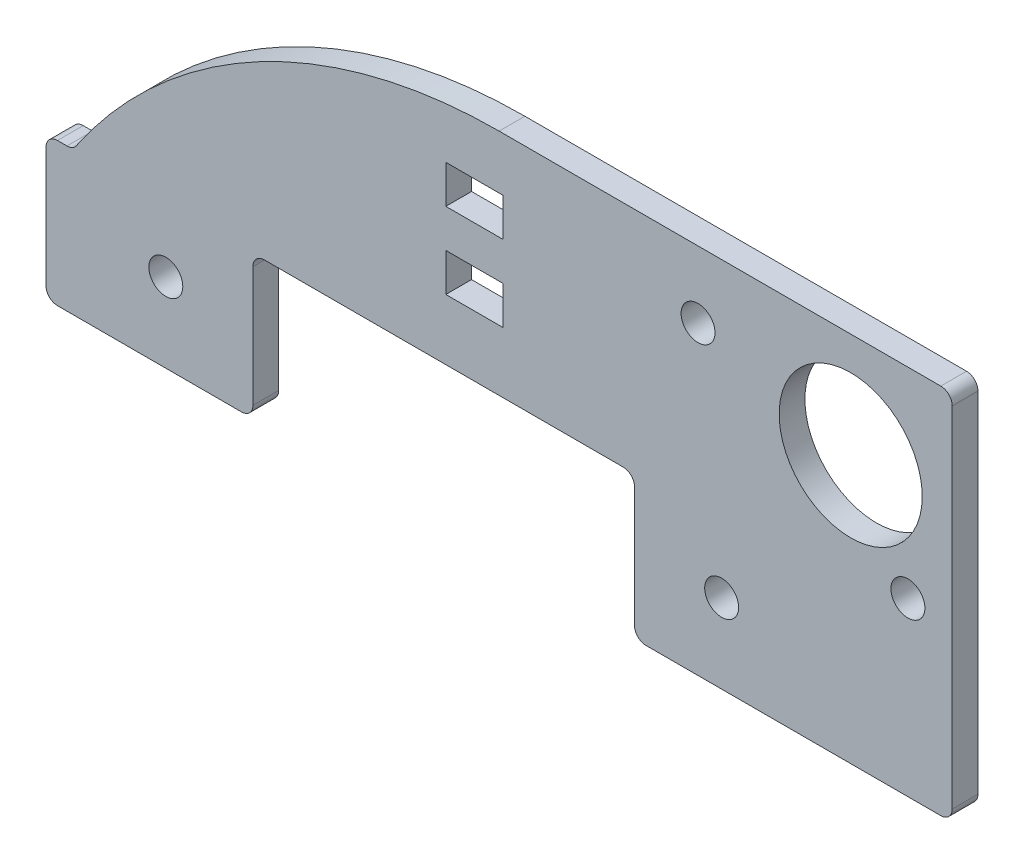
ISO-10303-21;
HEADER;
FILE_DESCRIPTION(('STEP AP214'),'2;1');
FILE_NAME('part.step','',(''),(''),'','','');
FILE_SCHEMA(('AUTOMOTIVE_DESIGN { 1 0 10303 214 1 1 1 1 }'));
ENDSEC;
DATA;
#1=APPLICATION_CONTEXT('core data for automotive mechanical design processes');
#2=APPLICATION_PROTOCOL_DEFINITION('international standard','automotive_design',2000,#1);
#3=PRODUCT_CONTEXT('',#1,'mechanical');
#4=PRODUCT('Part','Part','',(#3));
#5=PRODUCT_RELATED_PRODUCT_CATEGORY('part','',(#4));
#6=PRODUCT_DEFINITION_FORMATION('','',#4);
#7=PRODUCT_DEFINITION_CONTEXT('part definition',#1,'design');
#8=PRODUCT_DEFINITION('design','',#6,#7);
#9=PRODUCT_DEFINITION_SHAPE('','',#8);
#10=(LENGTH_UNIT() NAMED_UNIT(*) SI_UNIT(.MILLI.,.METRE.));
#11=(NAMED_UNIT(*) PLANE_ANGLE_UNIT() SI_UNIT($,.RADIAN.));
#12=(NAMED_UNIT(*) SI_UNIT($,.STERADIAN.) SOLID_ANGLE_UNIT());
#13=UNCERTAINTY_MEASURE_WITH_UNIT(LENGTH_MEASURE(1.E-05),#10,'distance_accuracy_value','');
#14=(GEOMETRIC_REPRESENTATION_CONTEXT(3) GLOBAL_UNCERTAINTY_ASSIGNED_CONTEXT((#13)) GLOBAL_UNIT_ASSIGNED_CONTEXT((#10,
#11,#12)) REPRESENTATION_CONTEXT('',''));
#15=CARTESIAN_POINT('',(0.,0.,0.));
#16=DIRECTION('',(0.,0.,1.));
#17=DIRECTION('',(1.,0.,0.));
#18=AXIS2_PLACEMENT_3D('',#15,#16,#17);
#19=CARTESIAN_POINT('',(-30.1625,9.24499999999995,1.7145));
#20=DIRECTION('',(0.,1.,0.));
#21=DIRECTION('',(-1.,0.,0.));
#22=AXIS2_PLACEMENT_3D('',#19,#20,#21);
#23=PLANE('',#22);
#24=DIRECTION('',(1.,0.,0.));
#25=VECTOR('',#24,1.);
#26=CARTESIAN_POINT('',(-30.1625,9.24499999999995,0.));
#27=LINE('',#26,#25);
#28=CARTESIAN_POINT('',(-29.4005,9.24499999999995,0.));
#29=VERTEX_POINT('',#28);
#30=CARTESIAN_POINT('',(-17.148900043,9.24499999999995,0.));
#31=VERTEX_POINT('',#30);
#32=EDGE_CURVE('E337',#29,#31,#27,.T.);
#33=ORIENTED_EDGE('',*,*,#32,.T.);
#34=DIRECTION('',(0.,0.,1.));
#35=VECTOR('',#34,1.);
#36=CARTESIAN_POINT('',(-17.148900043,9.24499999999995,1.7145));
#37=LINE('',#36,#35);
#38=CARTESIAN_POINT('',(-17.148900043,9.24499999999995,1.7145));
#39=VERTEX_POINT('',#38);
#40=EDGE_CURVE('E385',#31,#39,#37,.T.);
#41=ORIENTED_EDGE('',*,*,#40,.T.);
#42=DIRECTION('',(1.,0.,0.));
#43=VECTOR('',#42,1.);
#44=CARTESIAN_POINT('',(-30.1625,9.24499999999995,1.7145));
#45=LINE('',#44,#43);
#46=CARTESIAN_POINT('',(-29.4005,9.24499999999995,1.7145));
#47=VERTEX_POINT('',#46);
#48=EDGE_CURVE('E319',#47,#39,#45,.T.);
#49=ORIENTED_EDGE('',*,*,#48,.F.);
#50=DIRECTION('',(0.,0.,-1.));
#51=VECTOR('',#50,1.);
#52=CARTESIAN_POINT('',(-29.4005,9.24499999999995,1.7145));
#53=LINE('',#52,#51);
#54=EDGE_CURVE('E382',#47,#29,#53,.T.);
#55=ORIENTED_EDGE('',*,*,#54,.T.);
#56=EDGE_LOOP('',(#33,#41,#49,#55));
#57=FACE_BOUND('',#56,.T.);
#58=ADVANCED_FACE('F33',(#57),#23,.F.);
#59=CARTESIAN_POINT('',(0.,0.,1.7145));
#60=DIRECTION('',(0.,0.,1.));
#61=DIRECTION('',(1.,0.,0.));
#62=AXIS2_PLACEMENT_3D('',#59,#60,#61);
#63=PLANE('',#62);
#64=DIRECTION('',(0.,1.,0.));
#65=VECTOR('',#64,1.);
#66=CARTESIAN_POINT('',(9.01309995700001,18.77,1.7145));
#67=LINE('',#66,#65);
#68=CARTESIAN_POINT('',(9.013099957,10.007,1.7145));
#69=VERTEX_POINT('',#68);
#70=CARTESIAN_POINT('',(9.01309995700001,18.008,1.7145));
#71=VERTEX_POINT('',#70);
#72=EDGE_CURVE('E438',#69,#71,#67,.T.);
#73=ORIENTED_EDGE('',*,*,#72,.F.);
#74=CARTESIAN_POINT('',(9.775099957,10.007,1.7145));
#75=DIRECTION('',(0.,0.,1.));
#76=DIRECTION('',(1.,0.,0.));
#77=AXIS2_PLACEMENT_3D('',#74,#75,#76);
#78=CIRCLE('',#77,0.762);
#79=CARTESIAN_POINT('',(9.77509995699999,9.24499999999995,1.7145));
#80=VERTEX_POINT('',#79);
#81=EDGE_CURVE('E363',#69,#80,#78,.T.);
#82=ORIENTED_EDGE('',*,*,#81,.T.);
#83=CARTESIAN_POINT('',(29.4005,9.24499999999995,1.7145));
#84=VERTEX_POINT('',#83);
#85=EDGE_CURVE('E318',#80,#84,#45,.T.);
#86=ORIENTED_EDGE('',*,*,#85,.T.);
#87=CARTESIAN_POINT('',(29.4005,10.007,1.7145));
#88=DIRECTION('',(0.,0.,1.));
#89=DIRECTION('',(1.,0.,0.));
#90=AXIS2_PLACEMENT_3D('',#87,#88,#89);
#91=CIRCLE('',#90,0.762);
#92=CARTESIAN_POINT('',(30.1625,10.007,1.7145));
#93=VERTEX_POINT('',#92);
#94=EDGE_CURVE('E356',#84,#93,#91,.T.);
#95=ORIENTED_EDGE('',*,*,#94,.T.);
#96=DIRECTION('',(0.,1.,0.));
#97=VECTOR('',#96,1.);
#98=CARTESIAN_POINT('',(30.1625,34.0099999999999,1.7145));
#99=LINE('',#98,#97);
#100=CARTESIAN_POINT('',(30.1625,33.2479999999999,1.7145));
#101=VERTEX_POINT('',#100);
#102=EDGE_CURVE('E322',#93,#101,#99,.T.);
#103=ORIENTED_EDGE('',*,*,#102,.T.);
#104=CARTESIAN_POINT('',(29.4005,33.2479999999999,1.7145));
#105=DIRECTION('',(0.,0.,1.));
#106=DIRECTION('',(1.,0.,0.));
#107=AXIS2_PLACEMENT_3D('',#104,#105,#106);
#108=CIRCLE('',#107,0.762);
#109=CARTESIAN_POINT('',(29.4005,34.0099999999999,1.7145));
#110=VERTEX_POINT('',#109);
#111=EDGE_CURVE('E358',#101,#110,#108,.T.);
#112=ORIENTED_EDGE('',*,*,#111,.T.);
#113=DIRECTION('',(-1.,0.,0.));
#114=VECTOR('',#113,1.);
#115=CARTESIAN_POINT('',(30.1625,34.0099999999999,1.7145));
#116=LINE('',#115,#114);
#117=CARTESIAN_POINT('',(0.,34.0099999999999,1.7145));
#118=VERTEX_POINT('',#117);
#119=EDGE_CURVE('E325',#110,#118,#116,.T.);
#120=ORIENTED_EDGE('',*,*,#119,.T.);
#121=CARTESIAN_POINT('',(0.,0.,1.7145));
#122=DIRECTION('',(0.,0.,1.));
#123=DIRECTION('',(1.,0.,0.));
#124=AXIS2_PLACEMENT_3D('',#121,#122,#123);
#125=CIRCLE('',#124,34.0099999999999);
#126=CARTESIAN_POINT('',(-28.1374900737837,19.1039721615092,1.7145));
#127=VERTEX_POINT('',#126);
#128=EDGE_CURVE('E327',#118,#127,#125,.T.);
#129=ORIENTED_EDGE('',*,*,#128,.T.);
#130=CARTESIAN_POINT('',(-28.7679154614998,19.5319999999999,1.7145));
#131=DIRECTION('',(0.,0.,1.));
#132=DIRECTION('',(1.,0.,0.));
#133=AXIS2_PLACEMENT_3D('',#130,#131,#132);
#134=CIRCLE('',#133,0.762);
#135=CARTESIAN_POINT('',(-28.7679154614998,18.7699999999999,1.7145));
#136=VERTEX_POINT('',#135);
#137=EDGE_CURVE('E412',#127,#136,#134,.F.);
#138=ORIENTED_EDGE('',*,*,#137,.T.);
#139=DIRECTION('',(-1.,0.,0.));
#140=VECTOR('',#139,1.);
#141=CARTESIAN_POINT('',(-30.1625,18.7699999999999,1.7145));
#142=LINE('',#141,#140);
#143=CARTESIAN_POINT('',(-29.4005,18.7699999999999,1.7145));
#144=VERTEX_POINT('',#143);
#145=EDGE_CURVE('E311',#136,#144,#142,.T.);
#146=ORIENTED_EDGE('',*,*,#145,.T.);
#147=CARTESIAN_POINT('',(-29.4005,18.0079999999999,1.7145));
#148=DIRECTION('',(0.,0.,1.));
#149=DIRECTION('',(1.,0.,0.));
#150=AXIS2_PLACEMENT_3D('',#147,#148,#149);
#151=CIRCLE('',#150,0.762);
#152=CARTESIAN_POINT('',(-30.1625,18.0079999999999,1.7145));
#153=VERTEX_POINT('',#152);
#154=EDGE_CURVE('E352',#144,#153,#151,.T.);
#155=ORIENTED_EDGE('',*,*,#154,.T.);
#156=DIRECTION('',(0.,-1.,0.));
#157=VECTOR('',#156,1.);
#158=CARTESIAN_POINT('',(-30.1625,18.7699999999999,1.7145));
#159=LINE('',#158,#157);
#160=CARTESIAN_POINT('',(-30.1625,10.0069999999999,1.7145));
#161=VERTEX_POINT('',#160);
#162=EDGE_CURVE('E314',#153,#161,#159,.T.);
#163=ORIENTED_EDGE('',*,*,#162,.T.);
#164=CARTESIAN_POINT('',(-29.4005,10.0069999999999,1.7145));
#165=DIRECTION('',(0.,0.,1.));
#166=DIRECTION('',(1.,0.,0.));
#167=AXIS2_PLACEMENT_3D('',#164,#165,#166);
#168=CIRCLE('',#167,0.762);
#169=EDGE_CURVE('E354',#161,#47,#168,.T.);
#170=ORIENTED_EDGE('',*,*,#169,.T.);
#171=ORIENTED_EDGE('',*,*,#48,.T.);
#172=CARTESIAN_POINT('',(-17.148900043,10.0069999999999,1.7145));
#173=DIRECTION('',(0.,0.,1.));
#174=DIRECTION('',(1.,0.,0.));
#175=AXIS2_PLACEMENT_3D('',#172,#173,#174);
#176=CIRCLE('',#175,0.762);
#177=CARTESIAN_POINT('',(-16.386900043,10.007,1.7145));
#178=VERTEX_POINT('',#177);
#179=EDGE_CURVE('E360',#39,#178,#176,.T.);
#180=ORIENTED_EDGE('',*,*,#179,.T.);
#181=DIRECTION('',(0.,-1.,0.));
#182=VECTOR('',#181,1.);
#183=CARTESIAN_POINT('',(-16.386900043,18.7699999999999,1.7145));
#184=LINE('',#183,#182);
#185=CARTESIAN_POINT('',(-16.386900043,18.0079999999999,1.7145));
#186=VERTEX_POINT('',#185);
#187=EDGE_CURVE('E432',#186,#178,#184,.T.);
#188=ORIENTED_EDGE('',*,*,#187,.F.);
#189=CARTESIAN_POINT('',(-15.624900043,18.0079999999999,1.7145));
#190=DIRECTION('',(0.,0.,1.));
#191=DIRECTION('',(1.,0.,0.));
#192=AXIS2_PLACEMENT_3D('',#189,#190,#191);
#193=CIRCLE('',#192,0.762);
#194=CARTESIAN_POINT('',(-15.624900043,18.7699999999999,1.7145));
#195=VERTEX_POINT('',#194);
#196=EDGE_CURVE('E41',#186,#195,#193,.F.);
#197=ORIENTED_EDGE('',*,*,#196,.T.);
#198=DIRECTION('',(-1.,0.,0.));
#199=VECTOR('',#198,1.);
#200=CARTESIAN_POINT('',(-16.386900043,18.7699999999999,1.7145));
#201=LINE('',#200,#199);
#202=CARTESIAN_POINT('',(8.25109995700001,18.77,1.7145));
#203=VERTEX_POINT('',#202);
#204=EDGE_CURVE('E431',#203,#195,#201,.T.);
#205=ORIENTED_EDGE('',*,*,#204,.F.);
#206=CARTESIAN_POINT('',(8.25109995700001,18.008,1.7145));
#207=DIRECTION('',(0.,0.,1.));
#208=DIRECTION('',(1.,0.,0.));
#209=AXIS2_PLACEMENT_3D('',#206,#207,#208);
#210=CIRCLE('',#209,0.762);
#211=EDGE_CURVE('E423',#203,#71,#210,.F.);
#212=ORIENTED_EDGE('',*,*,#211,.T.);
#213=EDGE_LOOP('',(#73,#82,#86,#95,#103,#112,#120,#129,#138,#146,#155,#163,#170,#171,#180,#188,
#197,#205,#212));
#214=FACE_BOUND('',#213,.T.);
#215=DIRECTION('',(0.,-1.,0.));
#216=VECTOR('',#215,1.);
#217=CARTESIAN_POINT('',(-3.54914079696229,30.4366725441909,1.7145));
#218=LINE('',#217,#216);
#219=CARTESIAN_POINT('',(-3.54914079696229,30.4366725441909,1.7145));
#220=VERTEX_POINT('',#219);
#221=CARTESIAN_POINT('',(-3.54914079696229,27.8966725441909,1.7145));
#222=VERTEX_POINT('',#221);
#223=EDGE_CURVE('E233',#220,#222,#218,.T.);
#224=ORIENTED_EDGE('',*,*,#223,.F.);
#225=DIRECTION('',(-1.,0.,0.));
#226=VECTOR('',#225,1.);
#227=CARTESIAN_POINT('',(-3.54914079696229,30.4366725441909,1.7145));
#228=LINE('',#227,#226);
#229=CARTESIAN_POINT('',(0.260859203037711,30.4366725441909,1.7145));
#230=VERTEX_POINT('',#229);
#231=EDGE_CURVE('E238',#230,#220,#228,.T.);
#232=ORIENTED_EDGE('',*,*,#231,.F.);
#233=DIRECTION('',(0.,1.,0.));
#234=VECTOR('',#233,1.);
#235=CARTESIAN_POINT('',(0.260859203037711,30.4366725441909,1.7145));
#236=LINE('',#235,#234);
#237=CARTESIAN_POINT('',(0.260859203037709,27.8966725441909,1.7145));
#238=VERTEX_POINT('',#237);
#239=EDGE_CURVE('E217',#238,#230,#236,.T.);
#240=ORIENTED_EDGE('',*,*,#239,.F.);
#241=DIRECTION('',(1.,0.,0.));
#242=VECTOR('',#241,1.);
#243=CARTESIAN_POINT('',(-3.54914079696229,27.8966725441909,1.7145));
#244=LINE('',#243,#242);
#245=EDGE_CURVE('E228',#222,#238,#244,.T.);
#246=ORIENTED_EDGE('',*,*,#245,.F.);
#247=EDGE_LOOP('',(#224,#232,#240,#246));
#248=FACE_BOUND('',#247,.T.);
#249=DIRECTION('',(0.,-1.,0.));
#250=VECTOR('',#249,1.);
#251=CARTESIAN_POINT('',(-3.54914079696229,25.3566725441909,1.7145));
#252=LINE('',#251,#250);
#253=CARTESIAN_POINT('',(-3.54914079696229,25.3566725441909,1.7145));
#254=VERTEX_POINT('',#253);
#255=CARTESIAN_POINT('',(-3.54914079696229,22.8166725441909,1.7145));
#256=VERTEX_POINT('',#255);
#257=EDGE_CURVE('E260',#254,#256,#252,.T.);
#258=ORIENTED_EDGE('',*,*,#257,.F.);
#259=DIRECTION('',(-1.,0.,0.));
#260=VECTOR('',#259,1.);
#261=CARTESIAN_POINT('',(-3.54914079696229,25.3566725441909,1.7145));
#262=LINE('',#261,#260);
#263=CARTESIAN_POINT('',(0.260859203037713,25.3566725441909,1.7145));
#264=VERTEX_POINT('',#263);
#265=EDGE_CURVE('E269',#264,#254,#262,.T.);
#266=ORIENTED_EDGE('',*,*,#265,.F.);
#267=DIRECTION('',(0.,1.,0.));
#268=VECTOR('',#267,1.);
#269=CARTESIAN_POINT('',(0.260859203037713,25.3566725441909,1.7145));
#270=LINE('',#269,#268);
#271=CARTESIAN_POINT('',(0.260859203037712,22.8166725441909,1.7145));
#272=VERTEX_POINT('',#271);
#273=EDGE_CURVE('E266',#272,#264,#270,.T.);
#274=ORIENTED_EDGE('',*,*,#273,.F.);
#275=DIRECTION('',(1.,0.,0.));
#276=VECTOR('',#275,1.);
#277=CARTESIAN_POINT('',(-3.54914079696229,22.8166725441909,1.7145));
#278=LINE('',#277,#276);
#279=EDGE_CURVE('E262',#256,#272,#278,.T.);
#280=ORIENTED_EDGE('',*,*,#279,.F.);
#281=EDGE_LOOP('',(#258,#266,#274,#280));
#282=FACE_BOUND('',#281,.T.);
#283=CARTESIAN_POINT('',(13.2420888348737,29.565,1.7145));
#284=DIRECTION('',(0.,0.,1.));
#285=DIRECTION('',(1.,0.,0.));
#286=AXIS2_PLACEMENT_3D('',#283,#284,#285);
#287=CIRCLE('',#286,1.1303);
#288=CARTESIAN_POINT('',(14.3723888348737,29.565,1.7145));
#289=VERTEX_POINT('',#288);
#290=EDGE_CURVE('E287',#289,#289,#287,.T.);
#291=ORIENTED_EDGE('',*,*,#290,.F.);
#292=EDGE_LOOP('',(#291));
#293=FACE_BOUND('',#292,.T.);
#294=CARTESIAN_POINT('',(14.813099914,14.5155,1.7145));
#295=DIRECTION('',(0.,0.,1.));
#296=DIRECTION('',(1.,0.,0.));
#297=AXIS2_PLACEMENT_3D('',#294,#295,#296);
#298=CIRCLE('',#297,1.1303);
#299=CARTESIAN_POINT('',(15.943399914,14.5155,1.7145));
#300=VERTEX_POINT('',#299);
#301=EDGE_CURVE('E299',#300,#300,#298,.T.);
#302=ORIENTED_EDGE('',*,*,#301,.F.);
#303=EDGE_LOOP('',(#302));
#304=FACE_BOUND('',#303,.T.);
#305=CARTESIAN_POINT('',(-22.1869,14.5154999999999,1.7145));
#306=DIRECTION('',(0.,0.,1.));
#307=DIRECTION('',(1.,0.,0.));
#308=AXIS2_PLACEMENT_3D('',#305,#306,#307);
#309=CIRCLE('',#308,1.1303);
#310=CARTESIAN_POINT('',(-21.0566,14.5154999999999,1.7145));
#311=VERTEX_POINT('',#310);
#312=EDGE_CURVE('E305',#311,#311,#309,.T.);
#313=ORIENTED_EDGE('',*,*,#312,.F.);
#314=EDGE_LOOP('',(#313));
#315=FACE_BOUND('',#314,.T.);
#316=CARTESIAN_POINT('',(27.2120888348737,20.675,1.7145));
#317=DIRECTION('',(0.,0.,1.));
#318=DIRECTION('',(1.,0.,0.));
#319=AXIS2_PLACEMENT_3D('',#316,#317,#318);
#320=CIRCLE('',#319,1.1303);
#321=CARTESIAN_POINT('',(28.3423888348737,20.675,1.7145));
#322=VERTEX_POINT('',#321);
#323=EDGE_CURVE('E293',#322,#322,#320,.T.);
#324=ORIENTED_EDGE('',*,*,#323,.F.);
#325=EDGE_LOOP('',(#324));
#326=FACE_BOUND('',#325,.T.);
#327=CARTESIAN_POINT('',(23.4020888348737,27.025,1.7145));
#328=DIRECTION('',(0.,0.,1.));
#329=DIRECTION('',(1.,0.,0.));
#330=AXIS2_PLACEMENT_3D('',#327,#328,#329);
#331=CIRCLE('',#330,4.76250000000001);
#332=CARTESIAN_POINT('',(28.1645888348737,27.025,1.7145));
#333=VERTEX_POINT('',#332);
#334=EDGE_CURVE('E281',#333,#333,#331,.T.);
#335=ORIENTED_EDGE('',*,*,#334,.F.);
#336=EDGE_LOOP('',(#335));
#337=FACE_BOUND('',#336,.T.);
#338=ADVANCED_FACE('F235',(#214,#248,#282,#293,#304,#315,#326,#337),#63,.T.);
#339=CARTESIAN_POINT('',(0.,0.,0.));
#340=DIRECTION('',(0.,0.,1.));
#341=DIRECTION('',(1.,0.,0.));
#342=AXIS2_PLACEMENT_3D('',#339,#340,#341);
#343=PLANE('',#342);
#344=DIRECTION('',(1.,0.,0.));
#345=VECTOR('',#344,1.);
#346=CARTESIAN_POINT('',(-3.54914079696229,30.4366725441909,0.));
#347=LINE('',#346,#345);
#348=CARTESIAN_POINT('',(-3.54914079696229,30.4366725441909,0.));
#349=VERTEX_POINT('',#348);
#350=CARTESIAN_POINT('',(0.260859203037711,30.4366725441909,0.));
#351=VERTEX_POINT('',#350);
#352=EDGE_CURVE('E453',#349,#351,#347,.T.);
#353=ORIENTED_EDGE('',*,*,#352,.F.);
#354=DIRECTION('',(0.,1.,0.));
#355=VECTOR('',#354,1.);
#356=CARTESIAN_POINT('',(-3.54914079696229,30.4366725441909,0.));
#357=LINE('',#356,#355);
#358=CARTESIAN_POINT('',(-3.54914079696229,27.8966725441909,0.));
#359=VERTEX_POINT('',#358);
#360=EDGE_CURVE('E250',#359,#349,#357,.T.);
#361=ORIENTED_EDGE('',*,*,#360,.F.);
#362=DIRECTION('',(-1.,0.,0.));
#363=VECTOR('',#362,1.);
#364=CARTESIAN_POINT('',(-3.54914079696229,27.8966725441909,0.));
#365=LINE('',#364,#363);
#366=CARTESIAN_POINT('',(0.260859203037709,27.8966725441909,0.));
#367=VERTEX_POINT('',#366);
#368=EDGE_CURVE('E247',#367,#359,#365,.T.);
#369=ORIENTED_EDGE('',*,*,#368,.F.);
#370=DIRECTION('',(0.,-1.,0.));
#371=VECTOR('',#370,1.);
#372=CARTESIAN_POINT('',(0.260859203037711,30.4366725441909,0.));
#373=LINE('',#372,#371);
#374=EDGE_CURVE('E220',#351,#367,#373,.T.);
#375=ORIENTED_EDGE('',*,*,#374,.F.);
#376=EDGE_LOOP('',(#353,#361,#369,#375));
#377=FACE_BOUND('',#376,.T.);
#378=DIRECTION('',(1.,0.,0.));
#379=VECTOR('',#378,1.);
#380=CARTESIAN_POINT('',(-3.54914079696229,25.3566725441909,0.));
#381=LINE('',#380,#379);
#382=CARTESIAN_POINT('',(-3.54914079696229,25.3566725441909,0.));
#383=VERTEX_POINT('',#382);
#384=CARTESIAN_POINT('',(0.260859203037713,25.3566725441909,0.));
#385=VERTEX_POINT('',#384);
#386=EDGE_CURVE('E254',#383,#385,#381,.T.);
#387=ORIENTED_EDGE('',*,*,#386,.F.);
#388=DIRECTION('',(0.,1.,0.));
#389=VECTOR('',#388,1.);
#390=CARTESIAN_POINT('',(-3.54914079696229,25.3566725441909,0.));
#391=LINE('',#390,#389);
#392=CARTESIAN_POINT('',(-3.54914079696229,22.8166725441909,0.));
#393=VERTEX_POINT('',#392);
#394=EDGE_CURVE('E257',#393,#383,#391,.T.);
#395=ORIENTED_EDGE('',*,*,#394,.F.);
#396=DIRECTION('',(-1.,0.,0.));
#397=VECTOR('',#396,1.);
#398=CARTESIAN_POINT('',(-3.54914079696229,22.8166725441909,0.));
#399=LINE('',#398,#397);
#400=CARTESIAN_POINT('',(0.260859203037712,22.8166725441909,0.));
#401=VERTEX_POINT('',#400);
#402=EDGE_CURVE('E259',#401,#393,#399,.T.);
#403=ORIENTED_EDGE('',*,*,#402,.F.);
#404=DIRECTION('',(0.,-1.,0.));
#405=VECTOR('',#404,1.);
#406=CARTESIAN_POINT('',(0.260859203037713,25.3566725441909,0.));
#407=LINE('',#406,#405);
#408=EDGE_CURVE('E251',#385,#401,#407,.T.);
#409=ORIENTED_EDGE('',*,*,#408,.F.);
#410=EDGE_LOOP('',(#387,#395,#403,#409));
#411=FACE_BOUND('',#410,.T.);
#412=CARTESIAN_POINT('',(9.77509995699999,9.24499999999995,0.));
#413=VERTEX_POINT('',#412);
#414=CARTESIAN_POINT('',(29.4005,9.24499999999995,0.));
#415=VERTEX_POINT('',#414);
#416=EDGE_CURVE('E336',#413,#415,#27,.T.);
#417=ORIENTED_EDGE('',*,*,#416,.F.);
#418=CARTESIAN_POINT('',(9.775099957,10.007,0.));
#419=DIRECTION('',(0.,0.,1.));
#420=DIRECTION('',(1.,0.,0.));
#421=AXIS2_PLACEMENT_3D('',#418,#419,#420);
#422=CIRCLE('',#421,0.762);
#423=CARTESIAN_POINT('',(9.013099957,10.007,0.));
#424=VERTEX_POINT('',#423);
#425=EDGE_CURVE('E379',#413,#424,#422,.F.);
#426=ORIENTED_EDGE('',*,*,#425,.T.);
#427=DIRECTION('',(0.,-1.,0.));
#428=VECTOR('',#427,1.);
#429=CARTESIAN_POINT('',(9.01309995700001,18.77,0.));
#430=LINE('',#429,#428);
#431=CARTESIAN_POINT('',(9.01309995700001,18.008,0.));
#432=VERTEX_POINT('',#431);
#433=EDGE_CURVE('E437',#432,#424,#430,.T.);
#434=ORIENTED_EDGE('',*,*,#433,.F.);
#435=CARTESIAN_POINT('',(8.25109995700001,18.008,0.));
#436=DIRECTION('',(0.,0.,1.));
#437=DIRECTION('',(1.,0.,0.));
#438=AXIS2_PLACEMENT_3D('',#435,#436,#437);
#439=CIRCLE('',#438,0.762);
#440=CARTESIAN_POINT('',(8.25109995700001,18.77,0.));
#441=VERTEX_POINT('',#440);
#442=EDGE_CURVE('E425',#432,#441,#439,.T.);
#443=ORIENTED_EDGE('',*,*,#442,.T.);
#444=DIRECTION('',(1.,0.,0.));
#445=VECTOR('',#444,1.);
#446=CARTESIAN_POINT('',(-16.386900043,18.7699999999999,0.));
#447=LINE('',#446,#445);
#448=CARTESIAN_POINT('',(-15.624900043,18.7699999999999,0.));
#449=VERTEX_POINT('',#448);
#450=EDGE_CURVE('E444',#449,#441,#447,.T.);
#451=ORIENTED_EDGE('',*,*,#450,.F.);
#452=CARTESIAN_POINT('',(-15.624900043,18.0079999999999,0.));
#453=DIRECTION('',(0.,0.,1.));
#454=DIRECTION('',(1.,0.,0.));
#455=AXIS2_PLACEMENT_3D('',#452,#453,#454);
#456=CIRCLE('',#455,0.762);
#457=CARTESIAN_POINT('',(-16.386900043,18.0079999999999,0.));
#458=VERTEX_POINT('',#457);
#459=EDGE_CURVE('E11',#449,#458,#456,.T.);
#460=ORIENTED_EDGE('',*,*,#459,.T.);
#461=DIRECTION('',(0.,1.,0.));
#462=VECTOR('',#461,1.);
#463=CARTESIAN_POINT('',(-16.386900043,18.7699999999999,0.));
#464=LINE('',#463,#462);
#465=CARTESIAN_POINT('',(-16.386900043,10.0069999999999,0.));
#466=VERTEX_POINT('',#465);
#467=EDGE_CURVE('E263',#466,#458,#464,.T.);
#468=ORIENTED_EDGE('',*,*,#467,.F.);
#469=CARTESIAN_POINT('',(-17.148900043,10.0069999999999,0.));
#470=DIRECTION('',(0.,0.,1.));
#471=DIRECTION('',(1.,0.,0.));
#472=AXIS2_PLACEMENT_3D('',#469,#470,#471);
#473=CIRCLE('',#472,0.762);
#474=EDGE_CURVE('E377',#466,#31,#473,.F.);
#475=ORIENTED_EDGE('',*,*,#474,.T.);
#476=ORIENTED_EDGE('',*,*,#32,.F.);
#477=CARTESIAN_POINT('',(-29.4005,10.0069999999999,0.));
#478=DIRECTION('',(0.,0.,1.));
#479=DIRECTION('',(1.,0.,0.));
#480=AXIS2_PLACEMENT_3D('',#477,#478,#479);
#481=CIRCLE('',#480,0.762);
#482=CARTESIAN_POINT('',(-30.1625,10.0069999999999,0.));
#483=VERTEX_POINT('',#482);
#484=EDGE_CURVE('E371',#29,#483,#481,.F.);
#485=ORIENTED_EDGE('',*,*,#484,.T.);
#486=DIRECTION('',(0.,-1.,0.));
#487=VECTOR('',#486,1.);
#488=CARTESIAN_POINT('',(-30.1625,18.7699999999999,0.));
#489=LINE('',#488,#487);
#490=CARTESIAN_POINT('',(-30.1625,18.0079999999999,0.));
#491=VERTEX_POINT('',#490);
#492=EDGE_CURVE('E333',#491,#483,#489,.T.);
#493=ORIENTED_EDGE('',*,*,#492,.F.);
#494=CARTESIAN_POINT('',(-29.4005,18.0079999999999,0.));
#495=DIRECTION('',(0.,0.,1.));
#496=DIRECTION('',(1.,0.,0.));
#497=AXIS2_PLACEMENT_3D('',#494,#495,#496);
#498=CIRCLE('',#497,0.762);
#499=CARTESIAN_POINT('',(-29.4005,18.7699999999999,0.));
#500=VERTEX_POINT('',#499);
#501=EDGE_CURVE('E369',#491,#500,#498,.F.);
#502=ORIENTED_EDGE('',*,*,#501,.T.);
#503=DIRECTION('',(-1.,0.,0.));
#504=VECTOR('',#503,1.);
#505=CARTESIAN_POINT('',(-30.1625,18.7699999999999,0.));
#506=LINE('',#505,#504);
#507=CARTESIAN_POINT('',(-28.7679154614998,18.7699999999999,0.));
#508=VERTEX_POINT('',#507);
#509=EDGE_CURVE('E308',#508,#500,#506,.T.);
#510=ORIENTED_EDGE('',*,*,#509,.F.);
#511=CARTESIAN_POINT('',(-28.7679154614998,19.5319999999999,0.));
#512=DIRECTION('',(0.,0.,1.));
#513=DIRECTION('',(1.,0.,0.));
#514=AXIS2_PLACEMENT_3D('',#511,#512,#513);
#515=CIRCLE('',#514,0.762);
#516=CARTESIAN_POINT('',(-28.1374900737837,19.1039721615092,0.));
#517=VERTEX_POINT('',#516);
#518=EDGE_CURVE('E410',#508,#517,#515,.T.);
#519=ORIENTED_EDGE('',*,*,#518,.T.);
#520=CARTESIAN_POINT('',(0.,0.,0.));
#521=DIRECTION('',(0.,0.,1.));
#522=DIRECTION('',(1.,0.,0.));
#523=AXIS2_PLACEMENT_3D('',#520,#521,#522);
#524=CIRCLE('',#523,34.0099999999999);
#525=CARTESIAN_POINT('',(0.,34.0099999999999,0.));
#526=VERTEX_POINT('',#525);
#527=EDGE_CURVE('E315',#526,#517,#524,.T.);
#528=ORIENTED_EDGE('',*,*,#527,.F.);
#529=DIRECTION('',(-1.,0.,0.));
#530=VECTOR('',#529,1.);
#531=CARTESIAN_POINT('',(30.1625,34.0099999999999,0.));
#532=LINE('',#531,#530);
#533=CARTESIAN_POINT('',(29.4005,34.0099999999999,0.));
#534=VERTEX_POINT('',#533);
#535=EDGE_CURVE('E343',#534,#526,#532,.T.);
#536=ORIENTED_EDGE('',*,*,#535,.F.);
#537=CARTESIAN_POINT('',(29.4005,33.2479999999999,0.));
#538=DIRECTION('',(0.,0.,1.));
#539=DIRECTION('',(1.,0.,0.));
#540=AXIS2_PLACEMENT_3D('',#537,#538,#539);
#541=CIRCLE('',#540,0.762);
#542=CARTESIAN_POINT('',(30.1625,33.2479999999999,0.));
#543=VERTEX_POINT('',#542);
#544=EDGE_CURVE('E375',#534,#543,#541,.F.);
#545=ORIENTED_EDGE('',*,*,#544,.T.);
#546=DIRECTION('',(0.,1.,0.));
#547=VECTOR('',#546,1.);
#548=CARTESIAN_POINT('',(30.1625,34.0099999999999,0.));
#549=LINE('',#548,#547);
#550=CARTESIAN_POINT('',(30.1625,10.007,0.));
#551=VERTEX_POINT('',#550);
#552=EDGE_CURVE('E340',#551,#543,#549,.T.);
#553=ORIENTED_EDGE('',*,*,#552,.F.);
#554=CARTESIAN_POINT('',(29.4005,10.007,0.));
#555=DIRECTION('',(0.,0.,1.));
#556=DIRECTION('',(1.,0.,0.));
#557=AXIS2_PLACEMENT_3D('',#554,#555,#556);
#558=CIRCLE('',#557,0.762);
#559=EDGE_CURVE('E373',#551,#415,#558,.F.);
#560=ORIENTED_EDGE('',*,*,#559,.T.);
#561=EDGE_LOOP('',(#417,#426,#434,#443,#451,#460,#468,#475,#476,#485,#493,#502,#510,#519,#528,
#536,#545,#553,#560));
#562=FACE_BOUND('',#561,.T.);
#563=CARTESIAN_POINT('',(-22.1869,14.5154999999999,0.));
#564=DIRECTION('',(0.,0.,1.));
#565=DIRECTION('',(1.,0.,0.));
#566=AXIS2_PLACEMENT_3D('',#563,#564,#565);
#567=CIRCLE('',#566,1.1303);
#568=CARTESIAN_POINT('',(-21.0566,14.5154999999999,0.));
#569=VERTEX_POINT('',#568);
#570=EDGE_CURVE('E302',#569,#569,#567,.T.);
#571=ORIENTED_EDGE('',*,*,#570,.T.);
#572=EDGE_LOOP('',(#571));
#573=FACE_BOUND('',#572,.T.);
#574=CARTESIAN_POINT('',(14.813099914,14.5155,0.));
#575=DIRECTION('',(0.,0.,1.));
#576=DIRECTION('',(1.,0.,0.));
#577=AXIS2_PLACEMENT_3D('',#574,#575,#576);
#578=CIRCLE('',#577,1.1303);
#579=CARTESIAN_POINT('',(15.943399914,14.5155,0.));
#580=VERTEX_POINT('',#579);
#581=EDGE_CURVE('E296',#580,#580,#578,.T.);
#582=ORIENTED_EDGE('',*,*,#581,.T.);
#583=EDGE_LOOP('',(#582));
#584=FACE_BOUND('',#583,.T.);
#585=CARTESIAN_POINT('',(27.2120888348737,20.675,0.));
#586=DIRECTION('',(0.,0.,1.));
#587=DIRECTION('',(1.,0.,0.));
#588=AXIS2_PLACEMENT_3D('',#585,#586,#587);
#589=CIRCLE('',#588,1.1303);
#590=CARTESIAN_POINT('',(28.3423888348737,20.675,0.));
#591=VERTEX_POINT('',#590);
#592=EDGE_CURVE('E290',#591,#591,#589,.T.);
#593=ORIENTED_EDGE('',*,*,#592,.T.);
#594=EDGE_LOOP('',(#593));
#595=FACE_BOUND('',#594,.T.);
#596=CARTESIAN_POINT('',(13.2420888348737,29.565,0.));
#597=DIRECTION('',(0.,0.,1.));
#598=DIRECTION('',(1.,0.,0.));
#599=AXIS2_PLACEMENT_3D('',#596,#597,#598);
#600=CIRCLE('',#599,1.1303);
#601=CARTESIAN_POINT('',(14.3723888348737,29.565,0.));
#602=VERTEX_POINT('',#601);
#603=EDGE_CURVE('E284',#602,#602,#600,.T.);
#604=ORIENTED_EDGE('',*,*,#603,.T.);
#605=EDGE_LOOP('',(#604));
#606=FACE_BOUND('',#605,.T.);
#607=CARTESIAN_POINT('',(23.4020888348737,27.025,0.));
#608=DIRECTION('',(0.,0.,1.));
#609=DIRECTION('',(1.,0.,0.));
#610=AXIS2_PLACEMENT_3D('',#607,#608,#609);
#611=CIRCLE('',#610,4.76250000000001);
#612=CARTESIAN_POINT('',(28.1645888348737,27.025,0.));
#613=VERTEX_POINT('',#612);
#614=EDGE_CURVE('E249',#613,#613,#611,.T.);
#615=ORIENTED_EDGE('',*,*,#614,.T.);
#616=EDGE_LOOP('',(#615));
#617=FACE_BOUND('',#616,.T.);
#618=ADVANCED_FACE('F463',(#377,#411,#562,#573,#584,#595,#606,#617),#343,.F.);
#619=CARTESIAN_POINT('',(-30.1625,18.7699999999999,1.7145));
#620=DIRECTION('',(0.,-1.,0.));
#621=DIRECTION('',(1.,0.,0.));
#622=AXIS2_PLACEMENT_3D('',#619,#620,#621);
#623=PLANE('',#622);
#624=ORIENTED_EDGE('',*,*,#145,.F.);
#625=DIRECTION('',(0.,0.,1.));
#626=VECTOR('',#625,1.);
#627=CARTESIAN_POINT('',(-28.7679154614998,18.7699999999999,0.));
#628=LINE('',#627,#626);
#629=EDGE_CURVE('E405',#136,#508,#628,.F.);
#630=ORIENTED_EDGE('',*,*,#629,.T.);
#631=ORIENTED_EDGE('',*,*,#509,.T.);
#632=DIRECTION('',(0.,0.,-1.));
#633=VECTOR('',#632,1.);
#634=CARTESIAN_POINT('',(-29.4005,18.7699999999999,1.7145));
#635=LINE('',#634,#633);
#636=EDGE_CURVE('E403',#500,#144,#635,.F.);
#637=ORIENTED_EDGE('',*,*,#636,.T.);
#638=EDGE_LOOP('',(#624,#630,#631,#637));
#639=FACE_BOUND('',#638,.T.);
#640=ADVANCED_FACE('F466',(#639),#623,.F.);
#641=CARTESIAN_POINT('',(-30.1625,18.7699999999999,1.7145));
#642=DIRECTION('',(1.,0.,0.));
#643=DIRECTION('',(0.,0.,-1.));
#644=AXIS2_PLACEMENT_3D('',#641,#642,#643);
#645=PLANE('',#644);
#646=ORIENTED_EDGE('',*,*,#492,.T.);
#647=DIRECTION('',(0.,0.,-1.));
#648=VECTOR('',#647,1.);
#649=CARTESIAN_POINT('',(-30.1625,10.0069999999999,1.7145));
#650=LINE('',#649,#648);
#651=EDGE_CURVE('E401',#483,#161,#650,.F.);
#652=ORIENTED_EDGE('',*,*,#651,.T.);
#653=ORIENTED_EDGE('',*,*,#162,.F.);
#654=DIRECTION('',(0.,0.,-1.));
#655=VECTOR('',#654,1.);
#656=CARTESIAN_POINT('',(-30.1625,18.0079999999999,1.7145));
#657=LINE('',#656,#655);
#658=EDGE_CURVE('E398',#153,#491,#657,.T.);
#659=ORIENTED_EDGE('',*,*,#658,.T.);
#660=EDGE_LOOP('',(#646,#652,#653,#659));
#661=FACE_BOUND('',#660,.T.);
#662=ADVANCED_FACE('F514',(#661),#645,.F.);
#663=ORIENTED_EDGE('',*,*,#85,.F.);
#664=DIRECTION('',(0.,0.,1.));
#665=VECTOR('',#664,1.);
#666=CARTESIAN_POINT('',(9.77509995700001,9.24499999999995,1.7145));
#667=LINE('',#666,#665);
#668=EDGE_CURVE('E367',#80,#413,#667,.F.);
#669=ORIENTED_EDGE('',*,*,#668,.T.);
#670=ORIENTED_EDGE('',*,*,#416,.T.);
#671=DIRECTION('',(0.,0.,-1.));
#672=VECTOR('',#671,1.);
#673=CARTESIAN_POINT('',(29.4005,9.24499999999995,1.7145));
#674=LINE('',#673,#672);
#675=EDGE_CURVE('E365',#415,#84,#674,.F.);
#676=ORIENTED_EDGE('',*,*,#675,.T.);
#677=EDGE_LOOP('',(#663,#669,#670,#676));
#678=FACE_BOUND('',#677,.T.);
#679=ADVANCED_FACE('F504',(#678),#23,.F.);
#680=CARTESIAN_POINT('',(30.1625,34.0099999999999,1.7145));
#681=DIRECTION('',(-1.,0.,0.));
#682=DIRECTION('',(0.,0.,1.));
#683=AXIS2_PLACEMENT_3D('',#680,#681,#682);
#684=PLANE('',#683);
#685=ORIENTED_EDGE('',*,*,#552,.T.);
#686=DIRECTION('',(0.,0.,-1.));
#687=VECTOR('',#686,1.);
#688=CARTESIAN_POINT('',(30.1625,33.2479999999999,1.7145));
#689=LINE('',#688,#687);
#690=EDGE_CURVE('E396',#543,#101,#689,.F.);
#691=ORIENTED_EDGE('',*,*,#690,.T.);
#692=ORIENTED_EDGE('',*,*,#102,.F.);
#693=DIRECTION('',(0.,0.,-1.));
#694=VECTOR('',#693,1.);
#695=CARTESIAN_POINT('',(30.1625,10.007,1.7145));
#696=LINE('',#695,#694);
#697=EDGE_CURVE('E393',#93,#551,#696,.T.);
#698=ORIENTED_EDGE('',*,*,#697,.T.);
#699=EDGE_LOOP('',(#685,#691,#692,#698));
#700=FACE_BOUND('',#699,.T.);
#701=ADVANCED_FACE('F513',(#700),#684,.F.);
#702=CARTESIAN_POINT('',(30.1625,34.0099999999999,1.7145));
#703=DIRECTION('',(0.,-1.,0.));
#704=DIRECTION('',(0.,0.,-1.));
#705=AXIS2_PLACEMENT_3D('',#702,#703,#704);
#706=PLANE('',#705);
#707=ORIENTED_EDGE('',*,*,#119,.F.);
#708=DIRECTION('',(0.,0.,-1.));
#709=VECTOR('',#708,1.);
#710=CARTESIAN_POINT('',(29.4005,34.0099999999999,1.7145));
#711=LINE('',#710,#709);
#712=EDGE_CURVE('E390',#110,#534,#711,.T.);
#713=ORIENTED_EDGE('',*,*,#712,.T.);
#714=ORIENTED_EDGE('',*,*,#535,.T.);
#715=DIRECTION('',(0.,0.,-1.));
#716=VECTOR('',#715,1.);
#717=CARTESIAN_POINT('',(0.,34.0099999999999,1.7145));
#718=LINE('',#717,#716);
#719=EDGE_CURVE('E330',#118,#526,#718,.T.);
#720=ORIENTED_EDGE('',*,*,#719,.F.);
#721=EDGE_LOOP('',(#707,#713,#714,#720));
#722=FACE_BOUND('',#721,.T.);
#723=ADVANCED_FACE('F520',(#722),#706,.F.);
#724=CARTESIAN_POINT('',(0.,0.,1.7145));
#725=DIRECTION('',(0.,0.,-1.));
#726=DIRECTION('',(-1.,0.,0.));
#727=AXIS2_PLACEMENT_3D('',#724,#725,#726);
#728=CYLINDRICAL_SURFACE('',#727,34.0099999999999);
#729=ORIENTED_EDGE('',*,*,#527,.T.);
#730=DIRECTION('',(0.,0.,-1.));
#731=VECTOR('',#730,1.);
#732=CARTESIAN_POINT('',(-28.1374900737837,19.1039721615092,1.7145));
#733=LINE('',#732,#731);
#734=EDGE_CURVE('E408',#517,#127,#733,.F.);
#735=ORIENTED_EDGE('',*,*,#734,.T.);
#736=ORIENTED_EDGE('',*,*,#128,.F.);
#737=ORIENTED_EDGE('',*,*,#719,.T.);
#738=EDGE_LOOP('',(#729,#735,#736,#737));
#739=FACE_BOUND('',#738,.T.);
#740=ADVANCED_FACE('F602',(#739),#728,.T.);
#741=CARTESIAN_POINT('',(-22.1869,14.5154999999999,1.7145));
#742=DIRECTION('',(0.,0.,-1.));
#743=DIRECTION('',(-1.,0.,0.));
#744=AXIS2_PLACEMENT_3D('',#741,#742,#743);
#745=CYLINDRICAL_SURFACE('',#744,1.1303);
#746=ORIENTED_EDGE('',*,*,#312,.T.);
#747=EDGE_LOOP('',(#746));
#748=FACE_BOUND('',#747,.T.);
#749=ORIENTED_EDGE('',*,*,#570,.F.);
#750=EDGE_LOOP('',(#749));
#751=FACE_BOUND('',#750,.T.);
#752=ADVANCED_FACE('F597',(#748,#751),#745,.F.);
#753=CARTESIAN_POINT('',(14.813099914,14.5155,1.7145));
#754=DIRECTION('',(0.,0.,-1.));
#755=DIRECTION('',(-1.,0.,0.));
#756=AXIS2_PLACEMENT_3D('',#753,#754,#755);
#757=CYLINDRICAL_SURFACE('',#756,1.1303);
#758=ORIENTED_EDGE('',*,*,#301,.T.);
#759=EDGE_LOOP('',(#758));
#760=FACE_BOUND('',#759,.T.);
#761=ORIENTED_EDGE('',*,*,#581,.F.);
#762=EDGE_LOOP('',(#761));
#763=FACE_BOUND('',#762,.T.);
#764=ADVANCED_FACE('F592',(#760,#763),#757,.F.);
#765=CARTESIAN_POINT('',(27.2120888348737,20.675,1.7145));
#766=DIRECTION('',(0.,0.,-1.));
#767=DIRECTION('',(-1.,0.,0.));
#768=AXIS2_PLACEMENT_3D('',#765,#766,#767);
#769=CYLINDRICAL_SURFACE('',#768,1.1303);
#770=ORIENTED_EDGE('',*,*,#323,.T.);
#771=EDGE_LOOP('',(#770));
#772=FACE_BOUND('',#771,.T.);
#773=ORIENTED_EDGE('',*,*,#592,.F.);
#774=EDGE_LOOP('',(#773));
#775=FACE_BOUND('',#774,.T.);
#776=ADVANCED_FACE('F498',(#772,#775),#769,.F.);
#777=CARTESIAN_POINT('',(13.2420888348737,29.565,1.7145));
#778=DIRECTION('',(0.,0.,-1.));
#779=DIRECTION('',(-1.,0.,0.));
#780=AXIS2_PLACEMENT_3D('',#777,#778,#779);
#781=CYLINDRICAL_SURFACE('',#780,1.1303);
#782=ORIENTED_EDGE('',*,*,#290,.T.);
#783=EDGE_LOOP('',(#782));
#784=FACE_BOUND('',#783,.T.);
#785=ORIENTED_EDGE('',*,*,#603,.F.);
#786=EDGE_LOOP('',(#785));
#787=FACE_BOUND('',#786,.T.);
#788=ADVANCED_FACE('F488',(#784,#787),#781,.F.);
#789=CARTESIAN_POINT('',(23.4020888348737,27.025,1.7145));
#790=DIRECTION('',(0.,0.,-1.));
#791=DIRECTION('',(-1.,0.,0.));
#792=AXIS2_PLACEMENT_3D('',#789,#790,#791);
#793=CYLINDRICAL_SURFACE('',#792,4.76250000000001);
#794=ORIENTED_EDGE('',*,*,#334,.T.);
#795=EDGE_LOOP('',(#794));
#796=FACE_BOUND('',#795,.T.);
#797=ORIENTED_EDGE('',*,*,#614,.F.);
#798=EDGE_LOOP('',(#797));
#799=FACE_BOUND('',#798,.T.);
#800=ADVANCED_FACE('F485',(#796,#799),#793,.F.);
#801=CARTESIAN_POINT('',(-3.54914079696229,25.3566725441909,-4.57905011983927));
#802=DIRECTION('',(-1.,0.,0.));
#803=DIRECTION('',(0.,-1.,0.));
#804=AXIS2_PLACEMENT_3D('',#801,#802,#803);
#805=PLANE('',#804);
#806=ORIENTED_EDGE('',*,*,#394,.T.);
#807=DIRECTION('',(0.,0.,1.));
#808=VECTOR('',#807,1.);
#809=CARTESIAN_POINT('',(-3.54914079696229,25.3566725441909,-4.57905011983927));
#810=LINE('',#809,#808);
#811=EDGE_CURVE('E255',#383,#254,#810,.T.);
#812=ORIENTED_EDGE('',*,*,#811,.T.);
#813=ORIENTED_EDGE('',*,*,#257,.T.);
#814=DIRECTION('',(0.,0.,1.));
#815=VECTOR('',#814,1.);
#816=CARTESIAN_POINT('',(-3.54914079696229,22.8166725441909,-4.57905011983927));
#817=LINE('',#816,#815);
#818=EDGE_CURVE('E272',#393,#256,#817,.T.);
#819=ORIENTED_EDGE('',*,*,#818,.F.);
#820=EDGE_LOOP('',(#806,#812,#813,#819));
#821=FACE_BOUND('',#820,.T.);
#822=ADVANCED_FACE('F487',(#821),#805,.F.);
#823=CARTESIAN_POINT('',(-3.54914079696229,25.3566725441909,-4.57905011983927));
#824=DIRECTION('',(0.,1.,0.));
#825=DIRECTION('',(-1.,0.,0.));
#826=AXIS2_PLACEMENT_3D('',#823,#824,#825);
#827=PLANE('',#826);
#828=ORIENTED_EDGE('',*,*,#386,.T.);
#829=DIRECTION('',(0.,0.,1.));
#830=VECTOR('',#829,1.);
#831=CARTESIAN_POINT('',(0.260859203037713,25.3566725441909,-4.57905011983927));
#832=LINE('',#831,#830);
#833=EDGE_CURVE('E274',#385,#264,#832,.T.);
#834=ORIENTED_EDGE('',*,*,#833,.T.);
#835=ORIENTED_EDGE('',*,*,#265,.T.);
#836=ORIENTED_EDGE('',*,*,#811,.F.);
#837=EDGE_LOOP('',(#828,#834,#835,#836));
#838=FACE_BOUND('',#837,.T.);
#839=ADVANCED_FACE('F495',(#838),#827,.F.);
#840=CARTESIAN_POINT('',(0.260859203037713,25.3566725441909,-4.57905011983927));
#841=DIRECTION('',(1.,0.,0.));
#842=DIRECTION('',(0.,1.,0.));
#843=AXIS2_PLACEMENT_3D('',#840,#841,#842);
#844=PLANE('',#843);
#845=ORIENTED_EDGE('',*,*,#408,.T.);
#846=DIRECTION('',(0.,0.,1.));
#847=VECTOR('',#846,1.);
#848=CARTESIAN_POINT('',(0.260859203037712,22.8166725441909,-4.57905011983927));
#849=LINE('',#848,#847);
#850=EDGE_CURVE('E276',#401,#272,#849,.T.);
#851=ORIENTED_EDGE('',*,*,#850,.T.);
#852=ORIENTED_EDGE('',*,*,#273,.T.);
#853=ORIENTED_EDGE('',*,*,#833,.F.);
#854=EDGE_LOOP('',(#845,#851,#852,#853));
#855=FACE_BOUND('',#854,.T.);
#856=ADVANCED_FACE('F562',(#855),#844,.F.);
#857=CARTESIAN_POINT('',(-3.54914079696229,22.8166725441909,-4.57905011983927));
#858=DIRECTION('',(0.,-1.,0.));
#859=DIRECTION('',(0.,0.,-1.));
#860=AXIS2_PLACEMENT_3D('',#857,#858,#859);
#861=PLANE('',#860);
#862=ORIENTED_EDGE('',*,*,#402,.T.);
#863=ORIENTED_EDGE('',*,*,#818,.T.);
#864=ORIENTED_EDGE('',*,*,#279,.T.);
#865=ORIENTED_EDGE('',*,*,#850,.F.);
#866=EDGE_LOOP('',(#862,#863,#864,#865));
#867=FACE_BOUND('',#866,.T.);
#868=ADVANCED_FACE('F559',(#867),#861,.F.);
#869=CARTESIAN_POINT('',(-3.54914079696229,30.4366725441909,-4.57905011983927));
#870=DIRECTION('',(-1.,0.,0.));
#871=DIRECTION('',(0.,-1.,0.));
#872=AXIS2_PLACEMENT_3D('',#869,#870,#871);
#873=PLANE('',#872);
#874=ORIENTED_EDGE('',*,*,#360,.T.);
#875=DIRECTION('',(0.,0.,1.));
#876=VECTOR('',#875,1.);
#877=CARTESIAN_POINT('',(-3.54914079696229,30.4366725441909,-4.57905011983927));
#878=LINE('',#877,#876);
#879=EDGE_CURVE('E243',#349,#220,#878,.T.);
#880=ORIENTED_EDGE('',*,*,#879,.T.);
#881=ORIENTED_EDGE('',*,*,#223,.T.);
#882=DIRECTION('',(0.,0.,1.));
#883=VECTOR('',#882,1.);
#884=CARTESIAN_POINT('',(-3.54914079696229,27.8966725441909,-4.57905011983927));
#885=LINE('',#884,#883);
#886=EDGE_CURVE('E224',#359,#222,#885,.T.);
#887=ORIENTED_EDGE('',*,*,#886,.F.);
#888=EDGE_LOOP('',(#874,#880,#881,#887));
#889=FACE_BOUND('',#888,.T.);
#890=ADVANCED_FACE('F456',(#889),#873,.F.);
#891=CARTESIAN_POINT('',(-3.54914079696229,30.4366725441909,-4.57905011983927));
#892=DIRECTION('',(0.,1.,0.));
#893=DIRECTION('',(0.,0.,1.));
#894=AXIS2_PLACEMENT_3D('',#891,#892,#893);
#895=PLANE('',#894);
#896=ORIENTED_EDGE('',*,*,#352,.T.);
#897=DIRECTION('',(0.,0.,1.));
#898=VECTOR('',#897,1.);
#899=CARTESIAN_POINT('',(0.260859203037711,30.4366725441909,-4.57905011983927));
#900=LINE('',#899,#898);
#901=EDGE_CURVE('E223',#351,#230,#900,.T.);
#902=ORIENTED_EDGE('',*,*,#901,.T.);
#903=ORIENTED_EDGE('',*,*,#231,.T.);
#904=ORIENTED_EDGE('',*,*,#879,.F.);
#905=EDGE_LOOP('',(#896,#902,#903,#904));
#906=FACE_BOUND('',#905,.T.);
#907=ADVANCED_FACE('F461',(#906),#895,.F.);
#908=CARTESIAN_POINT('',(0.260859203037711,30.4366725441909,-4.57905011983927));
#909=DIRECTION('',(1.,0.,0.));
#910=DIRECTION('',(0.,1.,0.));
#911=AXIS2_PLACEMENT_3D('',#908,#909,#910);
#912=PLANE('',#911);
#913=ORIENTED_EDGE('',*,*,#374,.T.);
#914=DIRECTION('',(0.,0.,1.));
#915=VECTOR('',#914,1.);
#916=CARTESIAN_POINT('',(0.260859203037709,27.8966725441909,-4.57905011983927));
#917=LINE('',#916,#915);
#918=EDGE_CURVE('E212',#367,#238,#917,.T.);
#919=ORIENTED_EDGE('',*,*,#918,.T.);
#920=ORIENTED_EDGE('',*,*,#239,.T.);
#921=ORIENTED_EDGE('',*,*,#901,.F.);
#922=EDGE_LOOP('',(#913,#919,#920,#921));
#923=FACE_BOUND('',#922,.T.);
#924=ADVANCED_FACE('F214',(#923),#912,.F.);
#925=CARTESIAN_POINT('',(-3.54914079696229,27.8966725441909,-4.57905011983927));
#926=DIRECTION('',(0.,-1.,0.));
#927=DIRECTION('',(0.,0.,-1.));
#928=AXIS2_PLACEMENT_3D('',#925,#926,#927);
#929=PLANE('',#928);
#930=ORIENTED_EDGE('',*,*,#368,.T.);
#931=ORIENTED_EDGE('',*,*,#886,.T.);
#932=ORIENTED_EDGE('',*,*,#245,.T.);
#933=ORIENTED_EDGE('',*,*,#918,.F.);
#934=EDGE_LOOP('',(#930,#931,#932,#933));
#935=FACE_BOUND('',#934,.T.);
#936=ADVANCED_FACE('F229',(#935),#929,.F.);
#937=CARTESIAN_POINT('',(-16.386900043,18.7699999999999,-27.1272118913832));
#938=DIRECTION('',(-1.,0.,0.));
#939=DIRECTION('',(0.,-1.,0.));
#940=AXIS2_PLACEMENT_3D('',#937,#938,#939);
#941=PLANE('',#940);
#942=ORIENTED_EDGE('',*,*,#467,.T.);
#943=DIRECTION('',(0.,0.,1.));
#944=VECTOR('',#943,1.);
#945=CARTESIAN_POINT('',(-16.386900043,18.0079999999999,1.7145));
#946=LINE('',#945,#944);
#947=EDGE_CURVE('E421',#458,#186,#946,.T.);
#948=ORIENTED_EDGE('',*,*,#947,.T.);
#949=ORIENTED_EDGE('',*,*,#187,.T.);
#950=DIRECTION('',(0.,0.,1.));
#951=VECTOR('',#950,1.);
#952=CARTESIAN_POINT('',(-16.386900043,10.0069999999999,-27.1272118913832));
#953=LINE('',#952,#951);
#954=EDGE_CURVE('E388',#178,#466,#953,.F.);
#955=ORIENTED_EDGE('',*,*,#954,.T.);
#956=EDGE_LOOP('',(#942,#948,#949,#955));
#957=FACE_BOUND('',#956,.T.);
#958=ADVANCED_FACE('F441',(#957),#941,.F.);
#959=CARTESIAN_POINT('',(-16.386900043,18.7699999999999,-27.1272118913832));
#960=DIRECTION('',(0.,1.,0.));
#961=DIRECTION('',(-1.,0.,0.));
#962=AXIS2_PLACEMENT_3D('',#959,#960,#961);
#963=PLANE('',#962);
#964=ORIENTED_EDGE('',*,*,#450,.T.);
#965=DIRECTION('',(0.,0.,1.));
#966=VECTOR('',#965,1.);
#967=CARTESIAN_POINT('',(8.25109995700001,18.77,1.7145));
#968=LINE('',#967,#966);
#969=EDGE_CURVE('E416',#441,#203,#968,.T.);
#970=ORIENTED_EDGE('',*,*,#969,.T.);
#971=ORIENTED_EDGE('',*,*,#204,.T.);
#972=DIRECTION('',(0.,0.,1.));
#973=VECTOR('',#972,1.);
#974=CARTESIAN_POINT('',(-15.624900043,18.7699999999999,0.));
#975=LINE('',#974,#973);
#976=EDGE_CURVE('E414',#195,#449,#975,.F.);
#977=ORIENTED_EDGE('',*,*,#976,.T.);
#978=EDGE_LOOP('',(#964,#970,#971,#977));
#979=FACE_BOUND('',#978,.T.);
#980=ADVANCED_FACE('F435',(#979),#963,.F.);
#981=CARTESIAN_POINT('',(9.01309995700001,18.77,-27.1272118913832));
#982=DIRECTION('',(1.,0.,0.));
#983=DIRECTION('',(0.,1.,0.));
#984=AXIS2_PLACEMENT_3D('',#981,#982,#983);
#985=PLANE('',#984);
#986=ORIENTED_EDGE('',*,*,#72,.T.);
#987=DIRECTION('',(0.,0.,1.));
#988=VECTOR('',#987,1.);
#989=CARTESIAN_POINT('',(9.01309995700001,18.008,0.));
#990=LINE('',#989,#988);
#991=EDGE_CURVE('E419',#71,#432,#990,.F.);
#992=ORIENTED_EDGE('',*,*,#991,.T.);
#993=ORIENTED_EDGE('',*,*,#433,.T.);
#994=DIRECTION('',(0.,0.,1.));
#995=VECTOR('',#994,1.);
#996=CARTESIAN_POINT('',(9.013099957,10.007,-27.1272118913832));
#997=LINE('',#996,#995);
#998=EDGE_CURVE('E349',#424,#69,#997,.T.);
#999=ORIENTED_EDGE('',*,*,#998,.T.);
#1000=EDGE_LOOP('',(#986,#992,#993,#999));
#1001=FACE_BOUND('',#1000,.T.);
#1002=ADVANCED_FACE('F537',(#1001),#985,.F.);
#1003=CARTESIAN_POINT('',(9.775099957,10.007,-27.1272118913832));
#1004=DIRECTION('',(0.,0.,1.));
#1005=DIRECTION('',(1.,0.,0.));
#1006=AXIS2_PLACEMENT_3D('',#1003,#1004,#1005);
#1007=CYLINDRICAL_SURFACE('',#1006,0.762);
#1008=ORIENTED_EDGE('',*,*,#425,.F.);
#1009=ORIENTED_EDGE('',*,*,#668,.F.);
#1010=ORIENTED_EDGE('',*,*,#81,.F.);
#1011=ORIENTED_EDGE('',*,*,#998,.F.);
#1012=EDGE_LOOP('',(#1008,#1009,#1010,#1011));
#1013=FACE_BOUND('',#1012,.T.);
#1014=ADVANCED_FACE('F529',(#1013),#1007,.T.);
#1015=CARTESIAN_POINT('',(-17.148900043,10.0069999999999,1.7145));
#1016=DIRECTION('',(0.,0.,1.));
#1017=DIRECTION('',(1.,0.,0.));
#1018=AXIS2_PLACEMENT_3D('',#1015,#1016,#1017);
#1019=CYLINDRICAL_SURFACE('',#1018,0.762);
#1020=ORIENTED_EDGE('',*,*,#474,.F.);
#1021=ORIENTED_EDGE('',*,*,#954,.F.);
#1022=ORIENTED_EDGE('',*,*,#179,.F.);
#1023=ORIENTED_EDGE('',*,*,#40,.F.);
#1024=EDGE_LOOP('',(#1020,#1021,#1022,#1023));
#1025=FACE_BOUND('',#1024,.T.);
#1026=ADVANCED_FACE('F545',(#1025),#1019,.T.);
#1027=CARTESIAN_POINT('',(29.4005,33.2479999999999,1.7145));
#1028=DIRECTION('',(0.,0.,-1.));
#1029=DIRECTION('',(-1.,0.,0.));
#1030=AXIS2_PLACEMENT_3D('',#1027,#1028,#1029);
#1031=CYLINDRICAL_SURFACE('',#1030,0.762);
#1032=ORIENTED_EDGE('',*,*,#111,.F.);
#1033=ORIENTED_EDGE('',*,*,#690,.F.);
#1034=ORIENTED_EDGE('',*,*,#544,.F.);
#1035=ORIENTED_EDGE('',*,*,#712,.F.);
#1036=EDGE_LOOP('',(#1032,#1033,#1034,#1035));
#1037=FACE_BOUND('',#1036,.T.);
#1038=ADVANCED_FACE('F619',(#1037),#1031,.T.);
#1039=CARTESIAN_POINT('',(29.4005,10.007,1.7145));
#1040=DIRECTION('',(0.,0.,-1.));
#1041=DIRECTION('',(-1.,0.,0.));
#1042=AXIS2_PLACEMENT_3D('',#1039,#1040,#1041);
#1043=CYLINDRICAL_SURFACE('',#1042,0.762);
#1044=ORIENTED_EDGE('',*,*,#94,.F.);
#1045=ORIENTED_EDGE('',*,*,#675,.F.);
#1046=ORIENTED_EDGE('',*,*,#559,.F.);
#1047=ORIENTED_EDGE('',*,*,#697,.F.);
#1048=EDGE_LOOP('',(#1044,#1045,#1046,#1047));
#1049=FACE_BOUND('',#1048,.T.);
#1050=ADVANCED_FACE('F626',(#1049),#1043,.T.);
#1051=CARTESIAN_POINT('',(-29.4005,10.0069999999999,1.7145));
#1052=DIRECTION('',(0.,0.,-1.));
#1053=DIRECTION('',(-1.,0.,0.));
#1054=AXIS2_PLACEMENT_3D('',#1051,#1052,#1053);
#1055=CYLINDRICAL_SURFACE('',#1054,0.762);
#1056=ORIENTED_EDGE('',*,*,#169,.F.);
#1057=ORIENTED_EDGE('',*,*,#651,.F.);
#1058=ORIENTED_EDGE('',*,*,#484,.F.);
#1059=ORIENTED_EDGE('',*,*,#54,.F.);
#1060=EDGE_LOOP('',(#1056,#1057,#1058,#1059));
#1061=FACE_BOUND('',#1060,.T.);
#1062=ADVANCED_FACE('F628',(#1061),#1055,.T.);
#1063=CARTESIAN_POINT('',(-28.7679154614998,19.5319999999999,1.7145));
#1064=DIRECTION('',(0.,0.,-1.));
#1065=DIRECTION('',(-1.,0.,0.));
#1066=AXIS2_PLACEMENT_3D('',#1063,#1064,#1065);
#1067=CYLINDRICAL_SURFACE('',#1066,0.762);
#1068=ORIENTED_EDGE('',*,*,#137,.F.);
#1069=ORIENTED_EDGE('',*,*,#734,.F.);
#1070=ORIENTED_EDGE('',*,*,#518,.F.);
#1071=ORIENTED_EDGE('',*,*,#629,.F.);
#1072=EDGE_LOOP('',(#1068,#1069,#1070,#1071));
#1073=FACE_BOUND('',#1072,.T.);
#1074=ADVANCED_FACE('F634',(#1073),#1067,.F.);
#1075=CARTESIAN_POINT('',(-29.4005,18.0079999999999,1.7145));
#1076=DIRECTION('',(0.,0.,-1.));
#1077=DIRECTION('',(-1.,0.,0.));
#1078=AXIS2_PLACEMENT_3D('',#1075,#1076,#1077);
#1079=CYLINDRICAL_SURFACE('',#1078,0.762);
#1080=ORIENTED_EDGE('',*,*,#154,.F.);
#1081=ORIENTED_EDGE('',*,*,#636,.F.);
#1082=ORIENTED_EDGE('',*,*,#501,.F.);
#1083=ORIENTED_EDGE('',*,*,#658,.F.);
#1084=EDGE_LOOP('',(#1080,#1081,#1082,#1083));
#1085=FACE_BOUND('',#1084,.T.);
#1086=ADVANCED_FACE('F642',(#1085),#1079,.T.);
#1087=CARTESIAN_POINT('',(8.25109995700001,18.008,-27.1272118913832));
#1088=DIRECTION('',(0.,0.,-1.));
#1089=DIRECTION('',(-1.,0.,0.));
#1090=AXIS2_PLACEMENT_3D('',#1087,#1088,#1089);
#1091=CYLINDRICAL_SURFACE('',#1090,0.762);
#1092=ORIENTED_EDGE('',*,*,#442,.F.);
#1093=ORIENTED_EDGE('',*,*,#991,.F.);
#1094=ORIENTED_EDGE('',*,*,#211,.F.);
#1095=ORIENTED_EDGE('',*,*,#969,.F.);
#1096=EDGE_LOOP('',(#1092,#1093,#1094,#1095));
#1097=FACE_BOUND('',#1096,.T.);
#1098=ADVANCED_FACE('F536',(#1097),#1091,.F.);
#1099=CARTESIAN_POINT('',(-15.624900043,18.0079999999999,-27.1272118913832));
#1100=DIRECTION('',(0.,0.,-1.));
#1101=DIRECTION('',(-1.,0.,0.));
#1102=AXIS2_PLACEMENT_3D('',#1099,#1100,#1101);
#1103=CYLINDRICAL_SURFACE('',#1102,0.762);
#1104=ORIENTED_EDGE('',*,*,#459,.F.);
#1105=ORIENTED_EDGE('',*,*,#976,.F.);
#1106=ORIENTED_EDGE('',*,*,#196,.F.);
#1107=ORIENTED_EDGE('',*,*,#947,.F.);
#1108=EDGE_LOOP('',(#1104,#1105,#1106,#1107));
#1109=FACE_BOUND('',#1108,.T.);
#1110=ADVANCED_FACE('F35',(#1109),#1103,.F.);
#1111=CLOSED_SHELL('',(#58,#338,#618,#640,#662,#679,#701,#723,#740,#752,#764,#776,#788,#800,
#822,#839,#856,#868,#890,#907,#924,#936,#958,#980,#1002,#1014,#1026,#1038,#1050,#1062,#1074,
#1086,#1098,#1110));
#1112=MANIFOLD_SOLID_BREP('B2',#1111);
#1113=ADVANCED_BREP_SHAPE_REPRESENTATION('',(#18,#1112),#14);
#1114=SHAPE_DEFINITION_REPRESENTATION(#9,#1113);
ENDSEC;
END-ISO-10303-21;
